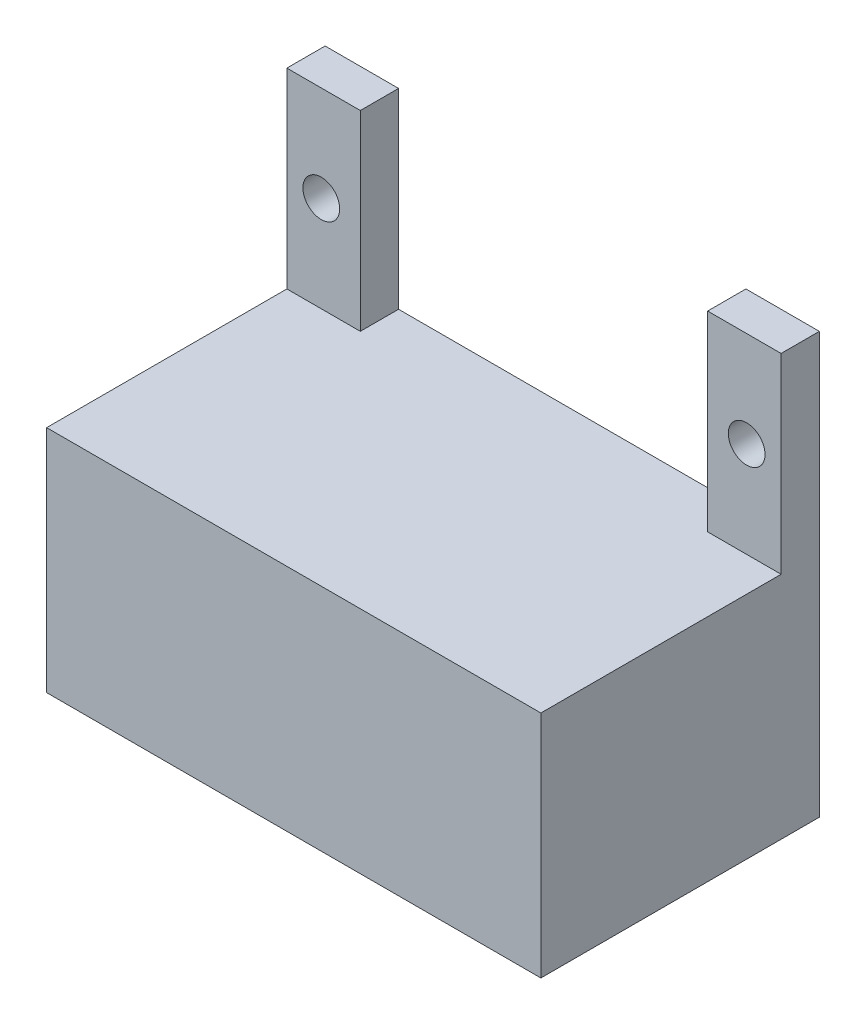
ISO-10303-21;
HEADER;
FILE_DESCRIPTION(('STEP AP214'),'2;1');
FILE_NAME('part.step','',(''),(''),'','','');
FILE_SCHEMA(('AUTOMOTIVE_DESIGN { 1 0 10303 214 1 1 1 1 }'));
ENDSEC;
DATA;
#1=APPLICATION_CONTEXT('core data for automotive mechanical design processes');
#2=APPLICATION_PROTOCOL_DEFINITION('international standard','automotive_design',2000,#1);
#3=PRODUCT_CONTEXT('',#1,'mechanical');
#4=PRODUCT('Part','Part','',(#3));
#5=PRODUCT_RELATED_PRODUCT_CATEGORY('part','',(#4));
#6=PRODUCT_DEFINITION_FORMATION('','',#4);
#7=PRODUCT_DEFINITION_CONTEXT('part definition',#1,'design');
#8=PRODUCT_DEFINITION('design','',#6,#7);
#9=PRODUCT_DEFINITION_SHAPE('','',#8);
#10=(LENGTH_UNIT() NAMED_UNIT(*) SI_UNIT(.MILLI.,.METRE.));
#11=(NAMED_UNIT(*) PLANE_ANGLE_UNIT() SI_UNIT($,.RADIAN.));
#12=(NAMED_UNIT(*) SI_UNIT($,.STERADIAN.) SOLID_ANGLE_UNIT());
#13=UNCERTAINTY_MEASURE_WITH_UNIT(LENGTH_MEASURE(1.E-05),#10,'distance_accuracy_value','');
#14=(GEOMETRIC_REPRESENTATION_CONTEXT(3) GLOBAL_UNCERTAINTY_ASSIGNED_CONTEXT((#13)) GLOBAL_UNIT_ASSIGNED_CONTEXT((#10,
#11,#12)) REPRESENTATION_CONTEXT('',''));
#15=CARTESIAN_POINT('',(0.,0.,0.));
#16=DIRECTION('',(0.,0.,1.));
#17=DIRECTION('',(1.,0.,0.));
#18=AXIS2_PLACEMENT_3D('',#15,#16,#17);
#19=CARTESIAN_POINT('',(0.,0.,2.5));
#20=DIRECTION('',(0.,0.,-1.));
#21=DIRECTION('',(-1.,0.,0.));
#22=AXIS2_PLACEMENT_3D('',#19,#20,#21);
#23=PLANE('',#22);
#24=CARTESIAN_POINT('',(30.05,21.25,2.5));
#25=DIRECTION('',(0.,0.,1.));
#26=DIRECTION('',(1.,0.,0.));
#27=AXIS2_PLACEMENT_3D('',#24,#25,#26);
#28=CIRCLE('',#27,1.2);
#29=CARTESIAN_POINT('',(31.25,21.25,2.5));
#30=VERTEX_POINT('',#29);
#31=EDGE_CURVE('E233',#30,#30,#28,.T.);
#32=ORIENTED_EDGE('',*,*,#31,.F.);
#33=EDGE_LOOP('',(#32));
#34=FACE_BOUND('',#33,.T.);
#35=DIRECTION('',(-1.,0.,0.));
#36=VECTOR('',#35,1.);
#37=CARTESIAN_POINT('',(0.,15.,2.5));
#38=LINE('',#37,#36);
#39=CARTESIAN_POINT('',(32.3,15.,2.5));
#40=VERTEX_POINT('',#39);
#41=CARTESIAN_POINT('',(27.5,15.,2.5));
#42=VERTEX_POINT('',#41);
#43=EDGE_CURVE('E58',#40,#42,#38,.T.);
#44=ORIENTED_EDGE('',*,*,#43,.F.);
#45=DIRECTION('',(0.,1.,0.));
#46=VECTOR('',#45,1.);
#47=CARTESIAN_POINT('',(32.3,27.5,2.5));
#48=LINE('',#47,#46);
#49=CARTESIAN_POINT('',(32.3,27.5,2.5));
#50=VERTEX_POINT('',#49);
#51=EDGE_CURVE('E112',#40,#50,#48,.T.);
#52=ORIENTED_EDGE('',*,*,#51,.T.);
#53=DIRECTION('',(-1.,0.,0.));
#54=VECTOR('',#53,1.);
#55=CARTESIAN_POINT('',(27.5,27.5,2.5));
#56=LINE('',#55,#54);
#57=CARTESIAN_POINT('',(27.5,27.5,2.5));
#58=VERTEX_POINT('',#57);
#59=EDGE_CURVE('E151',#50,#58,#56,.T.);
#60=ORIENTED_EDGE('',*,*,#59,.T.);
#61=DIRECTION('',(0.,-1.,0.));
#62=VECTOR('',#61,1.);
#63=CARTESIAN_POINT('',(27.5,15.,2.5));
#64=LINE('',#63,#62);
#65=EDGE_CURVE('E146',#58,#42,#64,.T.);
#66=ORIENTED_EDGE('',*,*,#65,.T.);
#67=EDGE_LOOP('',(#44,#52,#60,#66));
#68=FACE_BOUND('',#67,.T.);
#69=ADVANCED_FACE('F47',(#34,#68),#23,.F.);
#70=CARTESIAN_POINT('',(2.25,21.25,2.5));
#71=DIRECTION('',(0.,0.,1.));
#72=DIRECTION('',(1.,0.,0.));
#73=AXIS2_PLACEMENT_3D('',#70,#71,#72);
#74=CIRCLE('',#73,1.2);
#75=CARTESIAN_POINT('',(3.45,21.25,2.5));
#76=VERTEX_POINT('',#75);
#77=EDGE_CURVE('E163',#76,#76,#74,.T.);
#78=ORIENTED_EDGE('',*,*,#77,.F.);
#79=EDGE_LOOP('',(#78));
#80=FACE_BOUND('',#79,.T.);
#81=CARTESIAN_POINT('',(4.8,15.,2.5));
#82=VERTEX_POINT('',#81);
#83=CARTESIAN_POINT('',(0.,15.,2.5));
#84=VERTEX_POINT('',#83);
#85=EDGE_CURVE('E11',#82,#84,#38,.T.);
#86=ORIENTED_EDGE('',*,*,#85,.F.);
#87=DIRECTION('',(0.,1.,0.));
#88=VECTOR('',#87,1.);
#89=CARTESIAN_POINT('',(4.8,27.5,2.5));
#90=LINE('',#89,#88);
#91=CARTESIAN_POINT('',(4.8,27.5,2.5));
#92=VERTEX_POINT('',#91);
#93=EDGE_CURVE('E124',#82,#92,#90,.T.);
#94=ORIENTED_EDGE('',*,*,#93,.T.);
#95=DIRECTION('',(-1.,0.,0.));
#96=VECTOR('',#95,1.);
#97=CARTESIAN_POINT('',(0.,27.5,2.5));
#98=LINE('',#97,#96);
#99=CARTESIAN_POINT('',(0.,27.5,2.5));
#100=VERTEX_POINT('',#99);
#101=EDGE_CURVE('E73',#92,#100,#98,.T.);
#102=ORIENTED_EDGE('',*,*,#101,.T.);
#103=DIRECTION('',(0.,-1.,0.));
#104=VECTOR('',#103,1.);
#105=CARTESIAN_POINT('',(0.,0.,2.5));
#106=LINE('',#105,#104);
#107=EDGE_CURVE('E127',#100,#84,#106,.T.);
#108=ORIENTED_EDGE('',*,*,#107,.T.);
#109=EDGE_LOOP('',(#86,#94,#102,#108));
#110=FACE_BOUND('',#109,.T.);
#111=ADVANCED_FACE('F122',(#80,#110),#23,.F.);
#112=CARTESIAN_POINT('',(0.,0.,0.));
#113=DIRECTION('',(0.,0.,-1.));
#114=DIRECTION('',(-1.,0.,0.));
#115=AXIS2_PLACEMENT_3D('',#112,#113,#114);
#116=PLANE('',#115);
#117=CARTESIAN_POINT('',(2.25,21.25,0.));
#118=DIRECTION('',(0.,0.,1.));
#119=DIRECTION('',(1.,0.,0.));
#120=AXIS2_PLACEMENT_3D('',#117,#118,#119);
#121=CIRCLE('',#120,1.2);
#122=CARTESIAN_POINT('',(3.45,21.25,0.));
#123=VERTEX_POINT('',#122);
#124=EDGE_CURVE('E229',#123,#123,#121,.T.);
#125=ORIENTED_EDGE('',*,*,#124,.T.);
#126=EDGE_LOOP('',(#125));
#127=FACE_BOUND('',#126,.T.);
#128=DIRECTION('',(1.,0.,0.));
#129=VECTOR('',#128,1.);
#130=CARTESIAN_POINT('',(32.3,0.,0.));
#131=LINE('',#130,#129);
#132=CARTESIAN_POINT('',(0.,0.,0.));
#133=VERTEX_POINT('',#132);
#134=CARTESIAN_POINT('',(32.3,0.,0.));
#135=VERTEX_POINT('',#134);
#136=EDGE_CURVE('E158',#133,#135,#131,.T.);
#137=ORIENTED_EDGE('',*,*,#136,.F.);
#138=DIRECTION('',(0.,-1.,0.));
#139=VECTOR('',#138,1.);
#140=CARTESIAN_POINT('',(0.,0.,0.));
#141=LINE('',#140,#139);
#142=CARTESIAN_POINT('',(0.,27.5,0.));
#143=VERTEX_POINT('',#142);
#144=EDGE_CURVE('E107',#143,#133,#141,.T.);
#145=ORIENTED_EDGE('',*,*,#144,.F.);
#146=DIRECTION('',(-1.,0.,0.));
#147=VECTOR('',#146,1.);
#148=CARTESIAN_POINT('',(0.,27.5,0.));
#149=LINE('',#148,#147);
#150=CARTESIAN_POINT('',(4.8,27.5,0.));
#151=VERTEX_POINT('',#150);
#152=EDGE_CURVE('E177',#151,#143,#149,.T.);
#153=ORIENTED_EDGE('',*,*,#152,.F.);
#154=DIRECTION('',(0.,1.,0.));
#155=VECTOR('',#154,1.);
#156=CARTESIAN_POINT('',(4.8,27.5,0.));
#157=LINE('',#156,#155);
#158=CARTESIAN_POINT('',(4.8,15.,0.));
#159=VERTEX_POINT('',#158);
#160=EDGE_CURVE('E174',#159,#151,#157,.T.);
#161=ORIENTED_EDGE('',*,*,#160,.F.);
#162=DIRECTION('',(-1.,0.,0.));
#163=VECTOR('',#162,1.);
#164=CARTESIAN_POINT('',(4.8,15.,0.));
#165=LINE('',#164,#163);
#166=CARTESIAN_POINT('',(27.5,15.,0.));
#167=VERTEX_POINT('',#166);
#168=EDGE_CURVE('E136',#167,#159,#165,.T.);
#169=ORIENTED_EDGE('',*,*,#168,.F.);
#170=DIRECTION('',(0.,-1.,0.));
#171=VECTOR('',#170,1.);
#172=CARTESIAN_POINT('',(27.5,15.,0.));
#173=LINE('',#172,#171);
#174=CARTESIAN_POINT('',(27.5,27.5,0.));
#175=VERTEX_POINT('',#174);
#176=EDGE_CURVE('E169',#175,#167,#173,.T.);
#177=ORIENTED_EDGE('',*,*,#176,.F.);
#178=DIRECTION('',(-1.,0.,0.));
#179=VECTOR('',#178,1.);
#180=CARTESIAN_POINT('',(27.5,27.5,0.));
#181=LINE('',#180,#179);
#182=CARTESIAN_POINT('',(32.3,27.5,0.));
#183=VERTEX_POINT('',#182);
#184=EDGE_CURVE('E166',#183,#175,#181,.T.);
#185=ORIENTED_EDGE('',*,*,#184,.F.);
#186=DIRECTION('',(0.,1.,0.));
#187=VECTOR('',#186,1.);
#188=CARTESIAN_POINT('',(32.3,27.5,0.));
#189=LINE('',#188,#187);
#190=EDGE_CURVE('E162',#135,#183,#189,.T.);
#191=ORIENTED_EDGE('',*,*,#190,.F.);
#192=EDGE_LOOP('',(#137,#145,#153,#161,#169,#177,#185,#191));
#193=FACE_BOUND('',#192,.T.);
#194=CARTESIAN_POINT('',(30.05,21.25,0.));
#195=DIRECTION('',(0.,0.,1.));
#196=DIRECTION('',(1.,0.,0.));
#197=AXIS2_PLACEMENT_3D('',#194,#195,#196);
#198=CIRCLE('',#197,1.2);
#199=CARTESIAN_POINT('',(31.25,21.25,0.));
#200=VERTEX_POINT('',#199);
#201=EDGE_CURVE('E237',#200,#200,#198,.T.);
#202=ORIENTED_EDGE('',*,*,#201,.T.);
#203=EDGE_LOOP('',(#202));
#204=FACE_BOUND('',#203,.T.);
#205=ADVANCED_FACE('F215',(#127,#193,#204),#116,.T.);
#206=CARTESIAN_POINT('',(32.3,0.,2.5));
#207=DIRECTION('',(0.,1.,0.));
#208=DIRECTION('',(0.,0.,1.));
#209=AXIS2_PLACEMENT_3D('',#206,#207,#208);
#210=PLANE('',#209);
#211=ORIENTED_EDGE('',*,*,#136,.T.);
#212=DIRECTION('',(0.,0.,-1.));
#213=VECTOR('',#212,1.);
#214=CARTESIAN_POINT('',(32.3,0.,2.5));
#215=LINE('',#214,#213);
#216=CARTESIAN_POINT('',(32.3,0.,18.2));
#217=VERTEX_POINT('',#216);
#218=EDGE_CURVE('E51',#217,#135,#215,.T.);
#219=ORIENTED_EDGE('',*,*,#218,.F.);
#220=DIRECTION('',(1.,0.,0.));
#221=VECTOR('',#220,1.);
#222=CARTESIAN_POINT('',(0.,0.,18.2));
#223=LINE('',#222,#221);
#224=CARTESIAN_POINT('',(0.,0.,18.2));
#225=VERTEX_POINT('',#224);
#226=EDGE_CURVE('E259',#225,#217,#223,.T.);
#227=ORIENTED_EDGE('',*,*,#226,.F.);
#228=DIRECTION('',(0.,0.,-1.));
#229=VECTOR('',#228,1.);
#230=CARTESIAN_POINT('',(0.,0.,2.5));
#231=LINE('',#230,#229);
#232=EDGE_CURVE('E157',#225,#133,#231,.T.);
#233=ORIENTED_EDGE('',*,*,#232,.T.);
#234=EDGE_LOOP('',(#211,#219,#227,#233));
#235=FACE_BOUND('',#234,.T.);
#236=ADVANCED_FACE('F49',(#235),#210,.F.);
#237=CARTESIAN_POINT('',(32.3,27.5,2.5));
#238=DIRECTION('',(-1.,0.,0.));
#239=DIRECTION('',(0.,0.,1.));
#240=AXIS2_PLACEMENT_3D('',#237,#238,#239);
#241=PLANE('',#240);
#242=ORIENTED_EDGE('',*,*,#190,.T.);
#243=DIRECTION('',(0.,0.,-1.));
#244=VECTOR('',#243,1.);
#245=CARTESIAN_POINT('',(32.3,27.5,2.5));
#246=LINE('',#245,#244);
#247=EDGE_CURVE('E194',#50,#183,#246,.T.);
#248=ORIENTED_EDGE('',*,*,#247,.F.);
#249=ORIENTED_EDGE('',*,*,#51,.F.);
#250=DIRECTION('',(0.,0.,-1.));
#251=VECTOR('',#250,1.);
#252=CARTESIAN_POINT('',(32.3,15.,18.2));
#253=LINE('',#252,#251);
#254=CARTESIAN_POINT('',(32.3,15.,18.2));
#255=VERTEX_POINT('',#254);
#256=EDGE_CURVE('E241',#255,#40,#253,.T.);
#257=ORIENTED_EDGE('',*,*,#256,.F.);
#258=DIRECTION('',(0.,1.,0.));
#259=VECTOR('',#258,1.);
#260=CARTESIAN_POINT('',(32.3,15.,18.2));
#261=LINE('',#260,#259);
#262=EDGE_CURVE('E209',#217,#255,#261,.T.);
#263=ORIENTED_EDGE('',*,*,#262,.F.);
#264=ORIENTED_EDGE('',*,*,#218,.T.);
#265=EDGE_LOOP('',(#242,#248,#249,#257,#263,#264));
#266=FACE_BOUND('',#265,.T.);
#267=ADVANCED_FACE('F205',(#266),#241,.F.);
#268=CARTESIAN_POINT('',(27.5,27.5,2.5));
#269=DIRECTION('',(0.,-1.,0.));
#270=DIRECTION('',(0.,0.,-1.));
#271=AXIS2_PLACEMENT_3D('',#268,#269,#270);
#272=PLANE('',#271);
#273=ORIENTED_EDGE('',*,*,#184,.T.);
#274=DIRECTION('',(0.,0.,-1.));
#275=VECTOR('',#274,1.);
#276=CARTESIAN_POINT('',(27.5,27.5,2.5));
#277=LINE('',#276,#275);
#278=EDGE_CURVE('E191',#58,#175,#277,.T.);
#279=ORIENTED_EDGE('',*,*,#278,.F.);
#280=ORIENTED_EDGE('',*,*,#59,.F.);
#281=ORIENTED_EDGE('',*,*,#247,.T.);
#282=EDGE_LOOP('',(#273,#279,#280,#281));
#283=FACE_BOUND('',#282,.T.);
#284=ADVANCED_FACE('F220',(#283),#272,.F.);
#285=CARTESIAN_POINT('',(27.5,15.,2.5));
#286=DIRECTION('',(1.,0.,0.));
#287=DIRECTION('',(0.,0.,-1.));
#288=AXIS2_PLACEMENT_3D('',#285,#286,#287);
#289=PLANE('',#288);
#290=ORIENTED_EDGE('',*,*,#176,.T.);
#291=DIRECTION('',(0.,0.,-1.));
#292=VECTOR('',#291,1.);
#293=CARTESIAN_POINT('',(27.5,15.,2.5));
#294=LINE('',#293,#292);
#295=EDGE_CURVE('E140',#42,#167,#294,.T.);
#296=ORIENTED_EDGE('',*,*,#295,.F.);
#297=ORIENTED_EDGE('',*,*,#65,.F.);
#298=ORIENTED_EDGE('',*,*,#278,.T.);
#299=EDGE_LOOP('',(#290,#296,#297,#298));
#300=FACE_BOUND('',#299,.T.);
#301=ADVANCED_FACE('F223',(#300),#289,.F.);
#302=CARTESIAN_POINT('',(4.8,15.,2.5));
#303=DIRECTION('',(0.,-1.,0.));
#304=DIRECTION('',(0.,0.,-1.));
#305=AXIS2_PLACEMENT_3D('',#302,#303,#304);
#306=PLANE('',#305);
#307=ORIENTED_EDGE('',*,*,#168,.T.);
#308=DIRECTION('',(0.,0.,-1.));
#309=VECTOR('',#308,1.);
#310=CARTESIAN_POINT('',(4.8,15.,2.5));
#311=LINE('',#310,#309);
#312=EDGE_CURVE('E132',#82,#159,#311,.T.);
#313=ORIENTED_EDGE('',*,*,#312,.F.);
#314=ORIENTED_EDGE('',*,*,#85,.T.);
#315=DIRECTION('',(0.,0.,-1.));
#316=VECTOR('',#315,1.);
#317=CARTESIAN_POINT('',(0.,15.,18.2));
#318=LINE('',#317,#316);
#319=CARTESIAN_POINT('',(0.,15.,18.2));
#320=VERTEX_POINT('',#319);
#321=EDGE_CURVE('E248',#320,#84,#318,.T.);
#322=ORIENTED_EDGE('',*,*,#321,.F.);
#323=DIRECTION('',(-1.,0.,0.));
#324=VECTOR('',#323,1.);
#325=CARTESIAN_POINT('',(0.,15.,18.2));
#326=LINE('',#325,#324);
#327=EDGE_CURVE('E250',#255,#320,#326,.T.);
#328=ORIENTED_EDGE('',*,*,#327,.F.);
#329=ORIENTED_EDGE('',*,*,#256,.T.);
#330=ORIENTED_EDGE('',*,*,#43,.T.);
#331=ORIENTED_EDGE('',*,*,#295,.T.);
#332=EDGE_LOOP('',(#307,#313,#314,#322,#328,#329,#330,#331));
#333=FACE_BOUND('',#332,.T.);
#334=ADVANCED_FACE('F133',(#333),#306,.F.);
#335=CARTESIAN_POINT('',(4.8,27.5,2.5));
#336=DIRECTION('',(-1.,0.,0.));
#337=DIRECTION('',(0.,0.,1.));
#338=AXIS2_PLACEMENT_3D('',#335,#336,#337);
#339=PLANE('',#338);
#340=ORIENTED_EDGE('',*,*,#160,.T.);
#341=DIRECTION('',(0.,0.,-1.));
#342=VECTOR('',#341,1.);
#343=CARTESIAN_POINT('',(4.8,27.5,2.5));
#344=LINE('',#343,#342);
#345=EDGE_CURVE('E141',#92,#151,#344,.T.);
#346=ORIENTED_EDGE('',*,*,#345,.F.);
#347=ORIENTED_EDGE('',*,*,#93,.F.);
#348=ORIENTED_EDGE('',*,*,#312,.T.);
#349=EDGE_LOOP('',(#340,#346,#347,#348));
#350=FACE_BOUND('',#349,.T.);
#351=ADVANCED_FACE('F143',(#350),#339,.F.);
#352=CARTESIAN_POINT('',(0.,27.5,2.5));
#353=DIRECTION('',(0.,-1.,0.));
#354=DIRECTION('',(0.,0.,-1.));
#355=AXIS2_PLACEMENT_3D('',#352,#353,#354);
#356=PLANE('',#355);
#357=ORIENTED_EDGE('',*,*,#152,.T.);
#358=DIRECTION('',(0.,0.,-1.));
#359=VECTOR('',#358,1.);
#360=CARTESIAN_POINT('',(0.,27.5,2.5));
#361=LINE('',#360,#359);
#362=EDGE_CURVE('E184',#100,#143,#361,.T.);
#363=ORIENTED_EDGE('',*,*,#362,.F.);
#364=ORIENTED_EDGE('',*,*,#101,.F.);
#365=ORIENTED_EDGE('',*,*,#345,.T.);
#366=EDGE_LOOP('',(#357,#363,#364,#365));
#367=FACE_BOUND('',#366,.T.);
#368=ADVANCED_FACE('F275',(#367),#356,.F.);
#369=CARTESIAN_POINT('',(0.,0.,2.5));
#370=DIRECTION('',(1.,0.,0.));
#371=DIRECTION('',(0.,0.,-1.));
#372=AXIS2_PLACEMENT_3D('',#369,#370,#371);
#373=PLANE('',#372);
#374=ORIENTED_EDGE('',*,*,#144,.T.);
#375=ORIENTED_EDGE('',*,*,#232,.F.);
#376=DIRECTION('',(0.,-1.,0.));
#377=VECTOR('',#376,1.);
#378=CARTESIAN_POINT('',(0.,15.,18.2));
#379=LINE('',#378,#377);
#380=EDGE_CURVE('E253',#320,#225,#379,.T.);
#381=ORIENTED_EDGE('',*,*,#380,.F.);
#382=ORIENTED_EDGE('',*,*,#321,.T.);
#383=ORIENTED_EDGE('',*,*,#107,.F.);
#384=ORIENTED_EDGE('',*,*,#362,.T.);
#385=EDGE_LOOP('',(#374,#375,#381,#382,#383,#384));
#386=FACE_BOUND('',#385,.T.);
#387=ADVANCED_FACE('F270',(#386),#373,.F.);
#388=CARTESIAN_POINT('',(2.25,21.25,2.5));
#389=DIRECTION('',(0.,0.,-1.));
#390=DIRECTION('',(-1.,0.,0.));
#391=AXIS2_PLACEMENT_3D('',#388,#389,#390);
#392=CYLINDRICAL_SURFACE('',#391,1.2);
#393=ORIENTED_EDGE('',*,*,#77,.T.);
#394=EDGE_LOOP('',(#393));
#395=FACE_BOUND('',#394,.T.);
#396=ORIENTED_EDGE('',*,*,#124,.F.);
#397=EDGE_LOOP('',(#396));
#398=FACE_BOUND('',#397,.T.);
#399=ADVANCED_FACE('F283',(#395,#398),#392,.F.);
#400=CARTESIAN_POINT('',(30.05,21.25,2.5));
#401=DIRECTION('',(0.,0.,-1.));
#402=DIRECTION('',(-1.,0.,0.));
#403=AXIS2_PLACEMENT_3D('',#400,#401,#402);
#404=CYLINDRICAL_SURFACE('',#403,1.2);
#405=ORIENTED_EDGE('',*,*,#31,.T.);
#406=EDGE_LOOP('',(#405));
#407=FACE_BOUND('',#406,.T.);
#408=ORIENTED_EDGE('',*,*,#201,.F.);
#409=EDGE_LOOP('',(#408));
#410=FACE_BOUND('',#409,.T.);
#411=ADVANCED_FACE('F306',(#407,#410),#404,.F.);
#412=CARTESIAN_POINT('',(0.,0.,18.2));
#413=DIRECTION('',(0.,0.,1.));
#414=DIRECTION('',(1.,0.,0.));
#415=AXIS2_PLACEMENT_3D('',#412,#413,#414);
#416=PLANE('',#415);
#417=ORIENTED_EDGE('',*,*,#380,.T.);
#418=ORIENTED_EDGE('',*,*,#226,.T.);
#419=ORIENTED_EDGE('',*,*,#262,.T.);
#420=ORIENTED_EDGE('',*,*,#327,.T.);
#421=EDGE_LOOP('',(#417,#418,#419,#420));
#422=FACE_BOUND('',#421,.T.);
#423=ADVANCED_FACE('F267',(#422),#416,.T.);
#424=CLOSED_SHELL('',(#69,#111,#205,#236,#267,#284,#301,#334,#351,#368,#387,#399,#411,#423));
#425=MANIFOLD_SOLID_BREP('B2',#424);
#426=ADVANCED_BREP_SHAPE_REPRESENTATION('',(#18,#425),#14);
#427=SHAPE_DEFINITION_REPRESENTATION(#9,#426);
ENDSEC;
END-ISO-10303-21;
